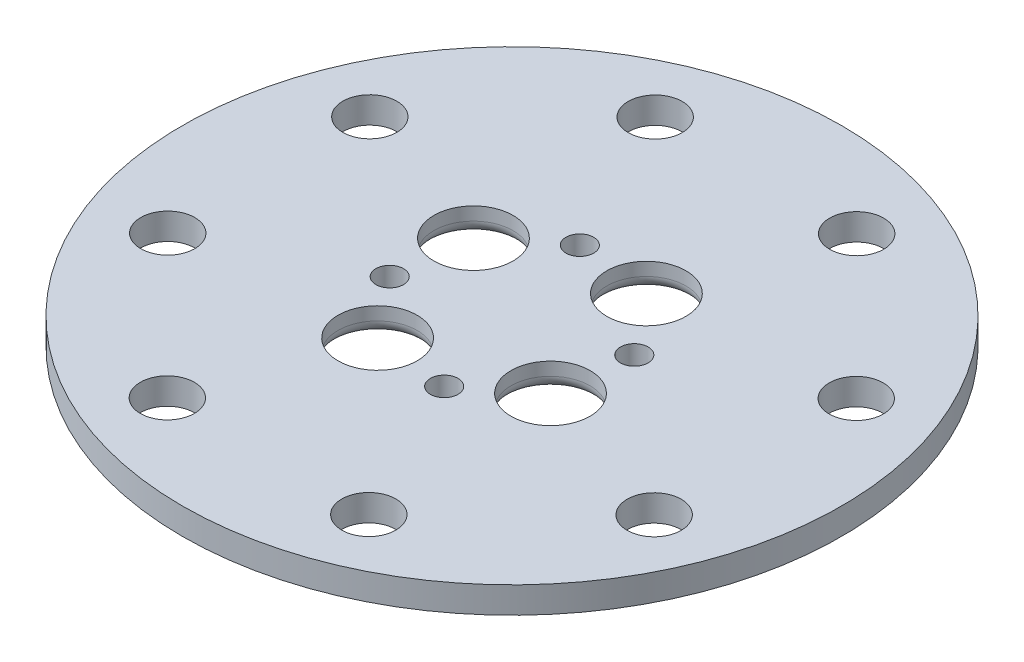
ISO-10303-21;
HEADER;
FILE_DESCRIPTION(('STEP AP214'),'2;1');
FILE_NAME('part.step','',(''),(''),'','','');
FILE_SCHEMA(('AUTOMOTIVE_DESIGN { 1 0 10303 214 1 1 1 1 }'));
ENDSEC;
DATA;
#1=APPLICATION_CONTEXT('core data for automotive mechanical design processes');
#2=APPLICATION_PROTOCOL_DEFINITION('international standard','automotive_design',2000,#1);
#3=PRODUCT_CONTEXT('',#1,'mechanical');
#4=PRODUCT('Part','Part','',(#3));
#5=PRODUCT_RELATED_PRODUCT_CATEGORY('part','',(#4));
#6=PRODUCT_DEFINITION_FORMATION('','',#4);
#7=PRODUCT_DEFINITION_CONTEXT('part definition',#1,'design');
#8=PRODUCT_DEFINITION('design','',#6,#7);
#9=PRODUCT_DEFINITION_SHAPE('','',#8);
#10=(LENGTH_UNIT() NAMED_UNIT(*) SI_UNIT(.MILLI.,.METRE.));
#11=(NAMED_UNIT(*) PLANE_ANGLE_UNIT() SI_UNIT($,.RADIAN.));
#12=(NAMED_UNIT(*) SI_UNIT($,.STERADIAN.) SOLID_ANGLE_UNIT());
#13=UNCERTAINTY_MEASURE_WITH_UNIT(LENGTH_MEASURE(1.E-05),#10,'distance_accuracy_value','');
#14=(GEOMETRIC_REPRESENTATION_CONTEXT(3) GLOBAL_UNCERTAINTY_ASSIGNED_CONTEXT((#13)) GLOBAL_UNIT_ASSIGNED_CONTEXT((#10,
#11,#12)) REPRESENTATION_CONTEXT('',''));
#15=CARTESIAN_POINT('',(0.,0.,0.));
#16=DIRECTION('',(0.,0.,1.));
#17=DIRECTION('',(1.,0.,0.));
#18=AXIS2_PLACEMENT_3D('',#15,#16,#17);
#19=CARTESIAN_POINT('',(0.,2.,0.));
#20=DIRECTION('',(0.,-1.,0.));
#21=DIRECTION('',(0.,0.,-1.));
#22=AXIS2_PLACEMENT_3D('',#19,#20,#21);
#23=CYLINDRICAL_SURFACE('',#22,25.);
#24=CARTESIAN_POINT('',(0.,2.,0.));
#25=DIRECTION('',(0.,1.,0.));
#26=DIRECTION('',(0.,0.,1.));
#27=AXIS2_PLACEMENT_3D('',#24,#25,#26);
#28=CIRCLE('',#27,25.);
#29=CARTESIAN_POINT('',(0.,2.,25.));
#30=VERTEX_POINT('',#29);
#31=EDGE_CURVE('E82',#30,#30,#28,.T.);
#32=ORIENTED_EDGE('',*,*,#31,.F.);
#33=EDGE_LOOP('',(#32));
#34=FACE_BOUND('',#33,.T.);
#35=CARTESIAN_POINT('',(0.,0.,0.));
#36=DIRECTION('',(0.,1.,0.));
#37=DIRECTION('',(0.,0.,1.));
#38=AXIS2_PLACEMENT_3D('',#35,#36,#37);
#39=CIRCLE('',#38,25.);
#40=CARTESIAN_POINT('',(0.,0.,25.));
#41=VERTEX_POINT('',#40);
#42=EDGE_CURVE('E83',#41,#41,#39,.T.);
#43=ORIENTED_EDGE('',*,*,#42,.T.);
#44=EDGE_LOOP('',(#43));
#45=FACE_BOUND('',#44,.T.);
#46=ADVANCED_FACE('F40',(#34,#45),#23,.T.);
#47=CARTESIAN_POINT('',(0.,2.,0.));
#48=DIRECTION('',(0.,1.,0.));
#49=DIRECTION('',(0.,0.,1.));
#50=AXIS2_PLACEMENT_3D('',#47,#48,#49);
#51=PLANE('',#50);
#52=CARTESIAN_POINT('',(-7.68064256948644,2.,18.4663946053315));
#53=DIRECTION('',(0.,-1.,0.));
#54=DIRECTION('',(0.,0.,-1.));
#55=AXIS2_PLACEMENT_3D('',#52,#53,#54);
#56=CIRCLE('',#55,2.05);
#57=CARTESIAN_POINT('',(-7.68064256948644,2.,16.4163946053315));
#58=VERTEX_POINT('',#57);
#59=EDGE_CURVE('E143',#58,#58,#56,.T.);
#60=ORIENTED_EDGE('',*,*,#59,.T.);
#61=EDGE_LOOP('',(#60));
#62=FACE_BOUND('',#61,.T.);
#63=CARTESIAN_POINT('',(7.62667840474221,2.,18.488747294251));
#64=DIRECTION('',(0.,-1.,0.));
#65=DIRECTION('',(0.,0.,-1.));
#66=AXIS2_PLACEMENT_3D('',#63,#64,#65);
#67=CIRCLE('',#66,2.05);
#68=CARTESIAN_POINT('',(7.62667840474221,2.,16.438747294251));
#69=VERTEX_POINT('',#68);
#70=EDGE_CURVE('E168',#69,#69,#67,.T.);
#71=ORIENTED_EDGE('',*,*,#70,.T.);
#72=EDGE_LOOP('',(#71));
#73=FACE_BOUND('',#72,.T.);
#74=CARTESIAN_POINT('',(18.4663946053311,2.,7.68064256948754));
#75=DIRECTION('',(0.,-1.,0.));
#76=DIRECTION('',(0.,0.,-1.));
#77=AXIS2_PLACEMENT_3D('',#74,#75,#76);
#78=CIRCLE('',#77,2.05);
#79=CARTESIAN_POINT('',(18.4663946053311,2.,5.63064256948754));
#80=VERTEX_POINT('',#79);
#81=EDGE_CURVE('E160',#80,#80,#78,.T.);
#82=ORIENTED_EDGE('',*,*,#81,.T.);
#83=EDGE_LOOP('',(#82));
#84=FACE_BOUND('',#83,.T.);
#85=CARTESIAN_POINT('',(18.4887472942505,2.,-7.62667840474111));
#86=DIRECTION('',(0.,-1.,0.));
#87=DIRECTION('',(0.,0.,-1.));
#88=AXIS2_PLACEMENT_3D('',#85,#86,#87);
#89=CIRCLE('',#88,2.05);
#90=CARTESIAN_POINT('',(18.4887472942505,2.,-9.67667840474111));
#91=VERTEX_POINT('',#90);
#92=EDGE_CURVE('E151',#91,#91,#89,.T.);
#93=ORIENTED_EDGE('',*,*,#92,.T.);
#94=EDGE_LOOP('',(#93));
#95=FACE_BOUND('',#94,.T.);
#96=CARTESIAN_POINT('',(7.6806425694871,2.,-18.46639460533));
#97=DIRECTION('',(0.,-1.,0.));
#98=DIRECTION('',(0.,0.,-1.));
#99=AXIS2_PLACEMENT_3D('',#96,#97,#98);
#100=CIRCLE('',#99,2.05);
#101=CARTESIAN_POINT('',(7.6806425694871,2.,-20.51639460533));
#102=VERTEX_POINT('',#101);
#103=EDGE_CURVE('E152',#102,#102,#100,.T.);
#104=ORIENTED_EDGE('',*,*,#103,.T.);
#105=EDGE_LOOP('',(#104));
#106=FACE_BOUND('',#105,.T.);
#107=CARTESIAN_POINT('',(-7.62667840474155,2.,-18.4887472942494));
#108=DIRECTION('',(0.,-1.,0.));
#109=DIRECTION('',(0.,0.,-1.));
#110=AXIS2_PLACEMENT_3D('',#107,#108,#109);
#111=CIRCLE('',#110,2.05);
#112=CARTESIAN_POINT('',(-7.62667840474155,2.,-20.5387472942494));
#113=VERTEX_POINT('',#112);
#114=EDGE_CURVE('E191',#113,#113,#111,.T.);
#115=ORIENTED_EDGE('',*,*,#114,.T.);
#116=EDGE_LOOP('',(#115));
#117=FACE_BOUND('',#116,.T.);
#118=CARTESIAN_POINT('',(-18.4663946053304,2.,-7.68064256948599));
#119=DIRECTION('',(0.,-1.,0.));
#120=DIRECTION('',(0.,0.,-1.));
#121=AXIS2_PLACEMENT_3D('',#118,#119,#120);
#122=CIRCLE('',#121,2.05);
#123=CARTESIAN_POINT('',(-18.4663946053304,2.,-9.73064256948599));
#124=VERTEX_POINT('',#123);
#125=EDGE_CURVE('E183',#124,#124,#122,.T.);
#126=ORIENTED_EDGE('',*,*,#125,.T.);
#127=EDGE_LOOP('',(#126));
#128=FACE_BOUND('',#127,.T.);
#129=CARTESIAN_POINT('',(-18.4887472942499,2.,7.62667840474266));
#130=DIRECTION('',(0.,-1.,0.));
#131=DIRECTION('',(0.,0.,-1.));
#132=AXIS2_PLACEMENT_3D('',#129,#130,#131);
#133=CIRCLE('',#132,2.05);
#134=CARTESIAN_POINT('',(-18.4887472942499,2.,5.57667840474266));
#135=VERTEX_POINT('',#134);
#136=EDGE_CURVE('E132',#135,#135,#133,.T.);
#137=ORIENTED_EDGE('',*,*,#136,.T.);
#138=EDGE_LOOP('',(#137));
#139=FACE_BOUND('',#138,.T.);
#140=CARTESIAN_POINT('',(-7.20972393812874,2.,2.06636897382066));
#141=DIRECTION('',(0.,1.,0.));
#142=DIRECTION('',(0.,0.,1.));
#143=AXIS2_PLACEMENT_3D('',#140,#141,#142);
#144=CIRCLE('',#143,1.05);
#145=CARTESIAN_POINT('',(-7.20972393812874,2.,3.11636897382066));
#146=VERTEX_POINT('',#145);
#147=EDGE_CURVE('E111',#146,#146,#144,.T.);
#148=ORIENTED_EDGE('',*,*,#147,.F.);
#149=EDGE_LOOP('',(#148));
#150=FACE_BOUND('',#149,.T.);
#151=CARTESIAN_POINT('',(2.06636897382105,2.,7.20972393812896));
#152=DIRECTION('',(0.,1.,0.));
#153=DIRECTION('',(0.,0.,1.));
#154=AXIS2_PLACEMENT_3D('',#151,#152,#153);
#155=CIRCLE('',#154,1.05);
#156=CARTESIAN_POINT('',(2.06636897382105,2.,8.25972393812896));
#157=VERTEX_POINT('',#156);
#158=EDGE_CURVE('E120',#157,#157,#155,.T.);
#159=ORIENTED_EDGE('',*,*,#158,.F.);
#160=EDGE_LOOP('',(#159));
#161=FACE_BOUND('',#160,.T.);
#162=CARTESIAN_POINT('',(7.20972393812935,2.,-2.06636897382083));
#163=DIRECTION('',(0.,1.,0.));
#164=DIRECTION('',(0.,0.,1.));
#165=AXIS2_PLACEMENT_3D('',#162,#163,#164);
#166=CIRCLE('',#165,1.05);
#167=CARTESIAN_POINT('',(7.20972393812935,2.,-1.01636897382083));
#168=VERTEX_POINT('',#167);
#169=EDGE_CURVE('E99',#168,#168,#166,.T.);
#170=ORIENTED_EDGE('',*,*,#169,.F.);
#171=EDGE_LOOP('',(#170));
#172=FACE_BOUND('',#171,.T.);
#173=CARTESIAN_POINT('',(-3.63690117331162,2.,6.55918820095631));
#174=DIRECTION('',(0.,1.,0.));
#175=DIRECTION('',(0.,0.,1.));
#176=AXIS2_PLACEMENT_3D('',#173,#174,#175);
#177=CIRCLE('',#176,3.);
#178=CARTESIAN_POINT('',(-3.63690117331162,2.,9.55918820095631));
#179=VERTEX_POINT('',#178);
#180=EDGE_CURVE('E95',#179,#179,#177,.T.);
#181=ORIENTED_EDGE('',*,*,#180,.F.);
#182=EDGE_LOOP('',(#181));
#183=FACE_BOUND('',#182,.T.);
#184=CARTESIAN_POINT('',(-6.5591882009563,2.,-3.63690117331165));
#185=DIRECTION('',(0.,1.,0.));
#186=DIRECTION('',(0.,0.,1.));
#187=AXIS2_PLACEMENT_3D('',#184,#185,#186);
#188=CIRCLE('',#187,3.);
#189=CARTESIAN_POINT('',(-6.5591882009563,2.,-0.636901173311649));
#190=VERTEX_POINT('',#189);
#191=EDGE_CURVE('E116',#190,#190,#188,.T.);
#192=ORIENTED_EDGE('',*,*,#191,.F.);
#193=EDGE_LOOP('',(#192));
#194=FACE_BOUND('',#193,.T.);
#195=CARTESIAN_POINT('',(3.63690117331167,2.,-6.55918820095629));
#196=DIRECTION('',(0.,1.,0.));
#197=DIRECTION('',(0.,0.,1.));
#198=AXIS2_PLACEMENT_3D('',#195,#196,#197);
#199=CIRCLE('',#198,3.);
#200=CARTESIAN_POINT('',(3.63690117331167,2.,-3.55918820095629));
#201=VERTEX_POINT('',#200);
#202=EDGE_CURVE('E131',#201,#201,#199,.T.);
#203=ORIENTED_EDGE('',*,*,#202,.F.);
#204=EDGE_LOOP('',(#203));
#205=FACE_BOUND('',#204,.T.);
#206=CARTESIAN_POINT('',(6.55918820095628,2.,3.63690117331169));
#207=DIRECTION('',(0.,1.,0.));
#208=DIRECTION('',(0.,0.,1.));
#209=AXIS2_PLACEMENT_3D('',#206,#207,#208);
#210=CIRCLE('',#209,3.);
#211=CARTESIAN_POINT('',(6.55918820095628,2.,6.63690117331169));
#212=VERTEX_POINT('',#211);
#213=EDGE_CURVE('E127',#212,#212,#210,.T.);
#214=ORIENTED_EDGE('',*,*,#213,.F.);
#215=EDGE_LOOP('',(#214));
#216=FACE_BOUND('',#215,.T.);
#217=CARTESIAN_POINT('',(-2.06636897382044,2.,-7.20972393812913));
#218=DIRECTION('',(0.,1.,0.));
#219=DIRECTION('',(0.,0.,1.));
#220=AXIS2_PLACEMENT_3D('',#217,#218,#219);
#221=CIRCLE('',#220,1.05);
#222=CARTESIAN_POINT('',(-2.06636897382044,2.,-6.15972393812913));
#223=VERTEX_POINT('',#222);
#224=EDGE_CURVE('E91',#223,#223,#221,.T.);
#225=ORIENTED_EDGE('',*,*,#224,.F.);
#226=EDGE_LOOP('',(#225));
#227=FACE_BOUND('',#226,.T.);
#228=ORIENTED_EDGE('',*,*,#31,.T.);
#229=EDGE_LOOP('',(#228));
#230=FACE_BOUND('',#229,.T.);
#231=ADVANCED_FACE('F204',(#62,#73,#84,#95,#106,#117,#128,#139,#150,#161,#172,#183,#194,#205,
#216,#227,#230),#51,.T.);
#232=CARTESIAN_POINT('',(0.,0.,0.));
#233=DIRECTION('',(0.,1.,0.));
#234=DIRECTION('',(0.,0.,1.));
#235=AXIS2_PLACEMENT_3D('',#232,#233,#234);
#236=PLANE('',#235);
#237=CARTESIAN_POINT('',(-7.68064256948644,0.,18.4663946053315));
#238=DIRECTION('',(0.,-1.,0.));
#239=DIRECTION('',(0.,0.,-1.));
#240=AXIS2_PLACEMENT_3D('',#237,#238,#239);
#241=CIRCLE('',#240,2.05);
#242=CARTESIAN_POINT('',(-7.68064256948644,0.,16.4163946053315));
#243=VERTEX_POINT('',#242);
#244=EDGE_CURVE('E172',#243,#243,#241,.T.);
#245=ORIENTED_EDGE('',*,*,#244,.F.);
#246=EDGE_LOOP('',(#245));
#247=FACE_BOUND('',#246,.T.);
#248=CARTESIAN_POINT('',(7.62667840474221,0.,18.488747294251));
#249=DIRECTION('',(0.,-1.,0.));
#250=DIRECTION('',(0.,0.,-1.));
#251=AXIS2_PLACEMENT_3D('',#248,#249,#250);
#252=CIRCLE('',#251,2.05);
#253=CARTESIAN_POINT('',(7.62667840474221,0.,16.438747294251));
#254=VERTEX_POINT('',#253);
#255=EDGE_CURVE('E164',#254,#254,#252,.T.);
#256=ORIENTED_EDGE('',*,*,#255,.F.);
#257=EDGE_LOOP('',(#256));
#258=FACE_BOUND('',#257,.T.);
#259=CARTESIAN_POINT('',(18.4663946053311,0.,7.68064256948754));
#260=DIRECTION('',(0.,-1.,0.));
#261=DIRECTION('',(0.,0.,-1.));
#262=AXIS2_PLACEMENT_3D('',#259,#260,#261);
#263=CIRCLE('',#262,2.05);
#264=CARTESIAN_POINT('',(18.4663946053311,0.,5.63064256948754));
#265=VERTEX_POINT('',#264);
#266=EDGE_CURVE('E156',#265,#265,#263,.T.);
#267=ORIENTED_EDGE('',*,*,#266,.F.);
#268=EDGE_LOOP('',(#267));
#269=FACE_BOUND('',#268,.T.);
#270=CARTESIAN_POINT('',(18.4887472942505,0.,-7.62667840474111));
#271=DIRECTION('',(0.,-1.,0.));
#272=DIRECTION('',(0.,0.,-1.));
#273=AXIS2_PLACEMENT_3D('',#270,#271,#272);
#274=CIRCLE('',#273,2.05);
#275=CARTESIAN_POINT('',(18.4887472942505,0.,-9.67667840474111));
#276=VERTEX_POINT('',#275);
#277=EDGE_CURVE('E147',#276,#276,#274,.T.);
#278=ORIENTED_EDGE('',*,*,#277,.F.);
#279=EDGE_LOOP('',(#278));
#280=FACE_BOUND('',#279,.T.);
#281=CARTESIAN_POINT('',(7.6806425694871,0.,-18.46639460533));
#282=DIRECTION('',(0.,-1.,0.));
#283=DIRECTION('',(0.,0.,-1.));
#284=AXIS2_PLACEMENT_3D('',#281,#282,#283);
#285=CIRCLE('',#284,2.05);
#286=CARTESIAN_POINT('',(7.6806425694871,0.,-20.51639460533));
#287=VERTEX_POINT('',#286);
#288=EDGE_CURVE('E195',#287,#287,#285,.T.);
#289=ORIENTED_EDGE('',*,*,#288,.F.);
#290=EDGE_LOOP('',(#289));
#291=FACE_BOUND('',#290,.T.);
#292=CARTESIAN_POINT('',(-7.62667840474155,0.,-18.4887472942494));
#293=DIRECTION('',(0.,-1.,0.));
#294=DIRECTION('',(0.,0.,-1.));
#295=AXIS2_PLACEMENT_3D('',#292,#293,#294);
#296=CIRCLE('',#295,2.05);
#297=CARTESIAN_POINT('',(-7.62667840474155,0.,-20.5387472942494));
#298=VERTEX_POINT('',#297);
#299=EDGE_CURVE('E187',#298,#298,#296,.T.);
#300=ORIENTED_EDGE('',*,*,#299,.F.);
#301=EDGE_LOOP('',(#300));
#302=FACE_BOUND('',#301,.T.);
#303=CARTESIAN_POINT('',(-18.4663946053304,0.,-7.68064256948599));
#304=DIRECTION('',(0.,-1.,0.));
#305=DIRECTION('',(0.,0.,-1.));
#306=AXIS2_PLACEMENT_3D('',#303,#304,#305);
#307=CIRCLE('',#306,2.05);
#308=CARTESIAN_POINT('',(-18.4663946053304,0.,-9.73064256948599));
#309=VERTEX_POINT('',#308);
#310=EDGE_CURVE('E179',#309,#309,#307,.T.);
#311=ORIENTED_EDGE('',*,*,#310,.F.);
#312=EDGE_LOOP('',(#311));
#313=FACE_BOUND('',#312,.T.);
#314=CARTESIAN_POINT('',(-18.4887472942499,0.,7.62667840474266));
#315=DIRECTION('',(0.,-1.,0.));
#316=DIRECTION('',(0.,0.,-1.));
#317=AXIS2_PLACEMENT_3D('',#314,#315,#316);
#318=CIRCLE('',#317,2.05);
#319=CARTESIAN_POINT('',(-18.4887472942499,0.,5.57667840474266));
#320=VERTEX_POINT('',#319);
#321=EDGE_CURVE('E139',#320,#320,#318,.T.);
#322=ORIENTED_EDGE('',*,*,#321,.F.);
#323=EDGE_LOOP('',(#322));
#324=FACE_BOUND('',#323,.T.);
#325=CARTESIAN_POINT('',(-6.5591882009563,0.,-3.63690117331165));
#326=DIRECTION('',(0.,1.,0.));
#327=DIRECTION('',(0.,0.,1.));
#328=AXIS2_PLACEMENT_3D('',#325,#326,#327);
#329=CIRCLE('',#328,4.);
#330=CARTESIAN_POINT('',(-6.5591882009563,0.,0.363098826688352));
#331=VERTEX_POINT('',#330);
#332=EDGE_CURVE('E66',#331,#331,#329,.T.);
#333=ORIENTED_EDGE('',*,*,#332,.T.);
#334=EDGE_LOOP('',(#333));
#335=FACE_BOUND('',#334,.T.);
#336=CARTESIAN_POINT('',(3.63690117331167,0.,-6.55918820095629));
#337=DIRECTION('',(0.,1.,0.));
#338=DIRECTION('',(0.,0.,1.));
#339=AXIS2_PLACEMENT_3D('',#336,#337,#338);
#340=CIRCLE('',#339,4.);
#341=CARTESIAN_POINT('',(3.63690117331167,0.,-2.55918820095629));
#342=VERTEX_POINT('',#341);
#343=EDGE_CURVE('E70',#342,#342,#340,.T.);
#344=ORIENTED_EDGE('',*,*,#343,.T.);
#345=EDGE_LOOP('',(#344));
#346=FACE_BOUND('',#345,.T.);
#347=CARTESIAN_POINT('',(6.55918820095628,0.,3.63690117331169));
#348=DIRECTION('',(0.,1.,0.));
#349=DIRECTION('',(0.,0.,1.));
#350=AXIS2_PLACEMENT_3D('',#347,#348,#349);
#351=CIRCLE('',#350,4.);
#352=CARTESIAN_POINT('',(6.55918820095628,0.,7.63690117331169));
#353=VERTEX_POINT('',#352);
#354=EDGE_CURVE('E74',#353,#353,#351,.T.);
#355=ORIENTED_EDGE('',*,*,#354,.T.);
#356=EDGE_LOOP('',(#355));
#357=FACE_BOUND('',#356,.T.);
#358=CARTESIAN_POINT('',(-3.63690117331162,0.,6.55918820095631));
#359=DIRECTION('',(0.,1.,0.));
#360=DIRECTION('',(0.,0.,1.));
#361=AXIS2_PLACEMENT_3D('',#358,#359,#360);
#362=CIRCLE('',#361,4.);
#363=CARTESIAN_POINT('',(-3.63690117331162,0.,10.5591882009563));
#364=VERTEX_POINT('',#363);
#365=EDGE_CURVE('E78',#364,#364,#362,.T.);
#366=ORIENTED_EDGE('',*,*,#365,.T.);
#367=EDGE_LOOP('',(#366));
#368=FACE_BOUND('',#367,.T.);
#369=CARTESIAN_POINT('',(-7.20972393812874,0.,2.06636897382066));
#370=DIRECTION('',(0.,1.,0.));
#371=DIRECTION('',(0.,0.,1.));
#372=AXIS2_PLACEMENT_3D('',#369,#370,#371);
#373=CIRCLE('',#372,1.05);
#374=CARTESIAN_POINT('',(-7.20972393812874,0.,3.11636897382066));
#375=VERTEX_POINT('',#374);
#376=EDGE_CURVE('E115',#375,#375,#373,.T.);
#377=ORIENTED_EDGE('',*,*,#376,.T.);
#378=EDGE_LOOP('',(#377));
#379=FACE_BOUND('',#378,.T.);
#380=CARTESIAN_POINT('',(2.06636897382105,0.,7.20972393812896));
#381=DIRECTION('',(0.,1.,0.));
#382=DIRECTION('',(0.,0.,1.));
#383=AXIS2_PLACEMENT_3D('',#380,#381,#382);
#384=CIRCLE('',#383,1.05);
#385=CARTESIAN_POINT('',(2.06636897382105,0.,8.25972393812896));
#386=VERTEX_POINT('',#385);
#387=EDGE_CURVE('E104',#386,#386,#384,.T.);
#388=ORIENTED_EDGE('',*,*,#387,.T.);
#389=EDGE_LOOP('',(#388));
#390=FACE_BOUND('',#389,.T.);
#391=CARTESIAN_POINT('',(7.20972393812935,0.,-2.06636897382083));
#392=DIRECTION('',(0.,1.,0.));
#393=DIRECTION('',(0.,0.,1.));
#394=AXIS2_PLACEMENT_3D('',#391,#392,#393);
#395=CIRCLE('',#394,1.05);
#396=CARTESIAN_POINT('',(7.20972393812935,0.,-1.01636897382083));
#397=VERTEX_POINT('',#396);
#398=EDGE_CURVE('E103',#397,#397,#395,.T.);
#399=ORIENTED_EDGE('',*,*,#398,.T.);
#400=EDGE_LOOP('',(#399));
#401=FACE_BOUND('',#400,.T.);
#402=CARTESIAN_POINT('',(-2.06636897382044,0.,-7.20972393812913));
#403=DIRECTION('',(0.,1.,0.));
#404=DIRECTION('',(0.,0.,1.));
#405=AXIS2_PLACEMENT_3D('',#402,#403,#404);
#406=CIRCLE('',#405,1.05);
#407=CARTESIAN_POINT('',(-2.06636897382044,0.,-6.15972393812913));
#408=VERTEX_POINT('',#407);
#409=EDGE_CURVE('E87',#408,#408,#406,.T.);
#410=ORIENTED_EDGE('',*,*,#409,.T.);
#411=EDGE_LOOP('',(#410));
#412=FACE_BOUND('',#411,.T.);
#413=ORIENTED_EDGE('',*,*,#42,.F.);
#414=EDGE_LOOP('',(#413));
#415=FACE_BOUND('',#414,.T.);
#416=ADVANCED_FACE('F215',(#247,#258,#269,#280,#291,#302,#313,#324,#335,#346,#357,#368,#379,
#390,#401,#412,#415),#236,.F.);
#417=CARTESIAN_POINT('',(-2.06636897382044,0.,-7.20972393812913));
#418=DIRECTION('',(0.,1.,0.));
#419=DIRECTION('',(0.,0.,1.));
#420=AXIS2_PLACEMENT_3D('',#417,#418,#419);
#421=CYLINDRICAL_SURFACE('',#420,1.05);
#422=ORIENTED_EDGE('',*,*,#409,.F.);
#423=EDGE_LOOP('',(#422));
#424=FACE_BOUND('',#423,.T.);
#425=ORIENTED_EDGE('',*,*,#224,.T.);
#426=EDGE_LOOP('',(#425));
#427=FACE_BOUND('',#426,.T.);
#428=ADVANCED_FACE('F218',(#424,#427),#421,.F.);
#429=CARTESIAN_POINT('',(6.55918820095628,0.,3.63690117331169));
#430=DIRECTION('',(0.,1.,0.));
#431=DIRECTION('',(0.,0.,1.));
#432=AXIS2_PLACEMENT_3D('',#429,#430,#431);
#433=CYLINDRICAL_SURFACE('',#432,3.);
#434=CARTESIAN_POINT('',(6.55918820095628,1.,3.63690117331169));
#435=DIRECTION('',(0.,1.,0.));
#436=DIRECTION('',(0.,0.,1.));
#437=AXIS2_PLACEMENT_3D('',#434,#435,#436);
#438=CIRCLE('',#437,3.);
#439=CARTESIAN_POINT('',(6.55918820095628,1.,6.63690117331169));
#440=VERTEX_POINT('',#439);
#441=EDGE_CURVE('E48',#440,#440,#438,.F.);
#442=ORIENTED_EDGE('',*,*,#441,.T.);
#443=EDGE_LOOP('',(#442));
#444=FACE_BOUND('',#443,.T.);
#445=ORIENTED_EDGE('',*,*,#213,.T.);
#446=EDGE_LOOP('',(#445));
#447=FACE_BOUND('',#446,.T.);
#448=ADVANCED_FACE('F297',(#444,#447),#433,.F.);
#449=CARTESIAN_POINT('',(3.63690117331167,0.,-6.55918820095629));
#450=DIRECTION('',(0.,1.,0.));
#451=DIRECTION('',(0.,0.,1.));
#452=AXIS2_PLACEMENT_3D('',#449,#450,#451);
#453=CYLINDRICAL_SURFACE('',#452,3.);
#454=CARTESIAN_POINT('',(3.63690117331167,1.,-6.55918820095629));
#455=DIRECTION('',(0.,1.,0.));
#456=DIRECTION('',(0.,0.,1.));
#457=AXIS2_PLACEMENT_3D('',#454,#455,#456);
#458=CIRCLE('',#457,3.);
#459=CARTESIAN_POINT('',(3.63690117331167,1.,-3.55918820095629));
#460=VERTEX_POINT('',#459);
#461=EDGE_CURVE('E54',#460,#460,#458,.F.);
#462=ORIENTED_EDGE('',*,*,#461,.T.);
#463=EDGE_LOOP('',(#462));
#464=FACE_BOUND('',#463,.T.);
#465=ORIENTED_EDGE('',*,*,#202,.T.);
#466=EDGE_LOOP('',(#465));
#467=FACE_BOUND('',#466,.T.);
#468=ADVANCED_FACE('F293',(#464,#467),#453,.F.);
#469=CARTESIAN_POINT('',(-6.5591882009563,0.,-3.63690117331165));
#470=DIRECTION('',(0.,1.,0.));
#471=DIRECTION('',(0.,0.,1.));
#472=AXIS2_PLACEMENT_3D('',#469,#470,#471);
#473=CYLINDRICAL_SURFACE('',#472,3.);
#474=CARTESIAN_POINT('',(-6.5591882009563,1.,-3.63690117331165));
#475=DIRECTION('',(0.,1.,0.));
#476=DIRECTION('',(0.,0.,1.));
#477=AXIS2_PLACEMENT_3D('',#474,#475,#476);
#478=CIRCLE('',#477,3.);
#479=CARTESIAN_POINT('',(-6.5591882009563,1.,-0.636901173311649));
#480=VERTEX_POINT('',#479);
#481=EDGE_CURVE('E60',#480,#480,#478,.F.);
#482=ORIENTED_EDGE('',*,*,#481,.T.);
#483=EDGE_LOOP('',(#482));
#484=FACE_BOUND('',#483,.T.);
#485=ORIENTED_EDGE('',*,*,#191,.T.);
#486=EDGE_LOOP('',(#485));
#487=FACE_BOUND('',#486,.T.);
#488=ADVANCED_FACE('F289',(#484,#487),#473,.F.);
#489=CARTESIAN_POINT('',(-3.63690117331162,0.,6.55918820095631));
#490=DIRECTION('',(0.,1.,0.));
#491=DIRECTION('',(0.,0.,1.));
#492=AXIS2_PLACEMENT_3D('',#489,#490,#491);
#493=CYLINDRICAL_SURFACE('',#492,3.);
#494=CARTESIAN_POINT('',(-3.63690117331162,1.,6.55918820095631));
#495=DIRECTION('',(0.,1.,0.));
#496=DIRECTION('',(0.,0.,1.));
#497=AXIS2_PLACEMENT_3D('',#494,#495,#496);
#498=CIRCLE('',#497,3.);
#499=CARTESIAN_POINT('',(-3.63690117331162,1.,9.55918820095631));
#500=VERTEX_POINT('',#499);
#501=EDGE_CURVE('E10',#500,#500,#498,.F.);
#502=ORIENTED_EDGE('',*,*,#501,.T.);
#503=EDGE_LOOP('',(#502));
#504=FACE_BOUND('',#503,.T.);
#505=ORIENTED_EDGE('',*,*,#180,.T.);
#506=EDGE_LOOP('',(#505));
#507=FACE_BOUND('',#506,.T.);
#508=ADVANCED_FACE('F292',(#504,#507),#493,.F.);
#509=CARTESIAN_POINT('',(7.20972393812935,0.,-2.06636897382083));
#510=DIRECTION('',(0.,1.,0.));
#511=DIRECTION('',(0.,0.,1.));
#512=AXIS2_PLACEMENT_3D('',#509,#510,#511);
#513=CYLINDRICAL_SURFACE('',#512,1.05);
#514=ORIENTED_EDGE('',*,*,#398,.F.);
#515=EDGE_LOOP('',(#514));
#516=FACE_BOUND('',#515,.T.);
#517=ORIENTED_EDGE('',*,*,#169,.T.);
#518=EDGE_LOOP('',(#517));
#519=FACE_BOUND('',#518,.T.);
#520=ADVANCED_FACE('F304',(#516,#519),#513,.F.);
#521=CARTESIAN_POINT('',(2.06636897382105,0.,7.20972393812896));
#522=DIRECTION('',(0.,1.,0.));
#523=DIRECTION('',(0.,0.,1.));
#524=AXIS2_PLACEMENT_3D('',#521,#522,#523);
#525=CYLINDRICAL_SURFACE('',#524,1.05);
#526=ORIENTED_EDGE('',*,*,#387,.F.);
#527=EDGE_LOOP('',(#526));
#528=FACE_BOUND('',#527,.T.);
#529=ORIENTED_EDGE('',*,*,#158,.T.);
#530=EDGE_LOOP('',(#529));
#531=FACE_BOUND('',#530,.T.);
#532=ADVANCED_FACE('F301',(#528,#531),#525,.F.);
#533=CARTESIAN_POINT('',(-7.20972393812874,0.,2.06636897382066));
#534=DIRECTION('',(0.,1.,0.));
#535=DIRECTION('',(0.,0.,1.));
#536=AXIS2_PLACEMENT_3D('',#533,#534,#535);
#537=CYLINDRICAL_SURFACE('',#536,1.05);
#538=ORIENTED_EDGE('',*,*,#376,.F.);
#539=EDGE_LOOP('',(#538));
#540=FACE_BOUND('',#539,.T.);
#541=ORIENTED_EDGE('',*,*,#147,.T.);
#542=EDGE_LOOP('',(#541));
#543=FACE_BOUND('',#542,.T.);
#544=ADVANCED_FACE('F259',(#540,#543),#537,.F.);
#545=CARTESIAN_POINT('',(-6.5591882009563,1.,-3.63690117331165));
#546=DIRECTION('',(0.,1.,0.));
#547=DIRECTION('',(0.,0.,1.));
#548=AXIS2_PLACEMENT_3D('',#545,#546,#547);
#549=TOROIDAL_SURFACE('',#548,4.,1.);
#550=ORIENTED_EDGE('',*,*,#481,.F.);
#551=EDGE_LOOP('',(#550));
#552=FACE_BOUND('',#551,.T.);
#553=ORIENTED_EDGE('',*,*,#332,.F.);
#554=EDGE_LOOP('',(#553));
#555=FACE_BOUND('',#554,.T.);
#556=ADVANCED_FACE('F255',(#552,#555),#549,.T.);
#557=CARTESIAN_POINT('',(3.63690117331167,1.,-6.55918820095629));
#558=DIRECTION('',(0.,1.,0.));
#559=DIRECTION('',(0.,0.,1.));
#560=AXIS2_PLACEMENT_3D('',#557,#558,#559);
#561=TOROIDAL_SURFACE('',#560,4.,1.);
#562=ORIENTED_EDGE('',*,*,#461,.F.);
#563=EDGE_LOOP('',(#562));
#564=FACE_BOUND('',#563,.T.);
#565=ORIENTED_EDGE('',*,*,#343,.F.);
#566=EDGE_LOOP('',(#565));
#567=FACE_BOUND('',#566,.T.);
#568=ADVANCED_FACE('F258',(#564,#567),#561,.T.);
#569=CARTESIAN_POINT('',(6.55918820095628,1.,3.63690117331169));
#570=DIRECTION('',(0.,1.,0.));
#571=DIRECTION('',(0.,0.,1.));
#572=AXIS2_PLACEMENT_3D('',#569,#570,#571);
#573=TOROIDAL_SURFACE('',#572,4.,1.);
#574=ORIENTED_EDGE('',*,*,#441,.F.);
#575=EDGE_LOOP('',(#574));
#576=FACE_BOUND('',#575,.T.);
#577=ORIENTED_EDGE('',*,*,#354,.F.);
#578=EDGE_LOOP('',(#577));
#579=FACE_BOUND('',#578,.T.);
#580=ADVANCED_FACE('F262',(#576,#579),#573,.T.);
#581=CARTESIAN_POINT('',(-3.63690117331162,1.,6.55918820095631));
#582=DIRECTION('',(0.,1.,0.));
#583=DIRECTION('',(0.,0.,1.));
#584=AXIS2_PLACEMENT_3D('',#581,#582,#583);
#585=TOROIDAL_SURFACE('',#584,4.,1.);
#586=ORIENTED_EDGE('',*,*,#501,.F.);
#587=EDGE_LOOP('',(#586));
#588=FACE_BOUND('',#587,.T.);
#589=ORIENTED_EDGE('',*,*,#365,.F.);
#590=EDGE_LOOP('',(#589));
#591=FACE_BOUND('',#590,.T.);
#592=ADVANCED_FACE('F42',(#588,#591),#585,.T.);
#593=CARTESIAN_POINT('',(-18.4887472942499,2.,7.62667840474266));
#594=DIRECTION('',(0.,-1.,0.));
#595=DIRECTION('',(0.,0.,-1.));
#596=AXIS2_PLACEMENT_3D('',#593,#594,#595);
#597=CYLINDRICAL_SURFACE('',#596,2.05);
#598=ORIENTED_EDGE('',*,*,#136,.F.);
#599=EDGE_LOOP('',(#598));
#600=FACE_BOUND('',#599,.T.);
#601=ORIENTED_EDGE('',*,*,#321,.T.);
#602=EDGE_LOOP('',(#601));
#603=FACE_BOUND('',#602,.T.);
#604=ADVANCED_FACE('F269',(#600,#603),#597,.F.);
#605=CARTESIAN_POINT('',(-18.4663946053304,2.,-7.68064256948599));
#606=DIRECTION('',(0.,-1.,0.));
#607=DIRECTION('',(0.,0.,-1.));
#608=AXIS2_PLACEMENT_3D('',#605,#606,#607);
#609=CYLINDRICAL_SURFACE('',#608,2.05);
#610=ORIENTED_EDGE('',*,*,#125,.F.);
#611=EDGE_LOOP('',(#610));
#612=FACE_BOUND('',#611,.T.);
#613=ORIENTED_EDGE('',*,*,#310,.T.);
#614=EDGE_LOOP('',(#613));
#615=FACE_BOUND('',#614,.T.);
#616=ADVANCED_FACE('F275',(#612,#615),#609,.F.);
#617=CARTESIAN_POINT('',(-7.62667840474155,2.,-18.4887472942494));
#618=DIRECTION('',(0.,-1.,0.));
#619=DIRECTION('',(0.,0.,-1.));
#620=AXIS2_PLACEMENT_3D('',#617,#618,#619);
#621=CYLINDRICAL_SURFACE('',#620,2.05);
#622=ORIENTED_EDGE('',*,*,#114,.F.);
#623=EDGE_LOOP('',(#622));
#624=FACE_BOUND('',#623,.T.);
#625=ORIENTED_EDGE('',*,*,#299,.T.);
#626=EDGE_LOOP('',(#625));
#627=FACE_BOUND('',#626,.T.);
#628=ADVANCED_FACE('F211',(#624,#627),#621,.F.);
#629=CARTESIAN_POINT('',(7.6806425694871,2.,-18.46639460533));
#630=DIRECTION('',(0.,-1.,0.));
#631=DIRECTION('',(0.,0.,-1.));
#632=AXIS2_PLACEMENT_3D('',#629,#630,#631);
#633=CYLINDRICAL_SURFACE('',#632,2.05);
#634=ORIENTED_EDGE('',*,*,#103,.F.);
#635=EDGE_LOOP('',(#634));
#636=FACE_BOUND('',#635,.T.);
#637=ORIENTED_EDGE('',*,*,#288,.T.);
#638=EDGE_LOOP('',(#637));
#639=FACE_BOUND('',#638,.T.);
#640=ADVANCED_FACE('F207',(#636,#639),#633,.F.);
#641=CARTESIAN_POINT('',(18.4887472942505,2.,-7.62667840474111));
#642=DIRECTION('',(0.,-1.,0.));
#643=DIRECTION('',(0.,0.,-1.));
#644=AXIS2_PLACEMENT_3D('',#641,#642,#643);
#645=CYLINDRICAL_SURFACE('',#644,2.05);
#646=ORIENTED_EDGE('',*,*,#92,.F.);
#647=EDGE_LOOP('',(#646));
#648=FACE_BOUND('',#647,.T.);
#649=ORIENTED_EDGE('',*,*,#277,.T.);
#650=EDGE_LOOP('',(#649));
#651=FACE_BOUND('',#650,.T.);
#652=ADVANCED_FACE('F210',(#648,#651),#645,.F.);
#653=CARTESIAN_POINT('',(18.4663946053311,2.,7.68064256948754));
#654=DIRECTION('',(0.,-1.,0.));
#655=DIRECTION('',(0.,0.,-1.));
#656=AXIS2_PLACEMENT_3D('',#653,#654,#655);
#657=CYLINDRICAL_SURFACE('',#656,2.05);
#658=ORIENTED_EDGE('',*,*,#81,.F.);
#659=EDGE_LOOP('',(#658));
#660=FACE_BOUND('',#659,.T.);
#661=ORIENTED_EDGE('',*,*,#266,.T.);
#662=EDGE_LOOP('',(#661));
#663=FACE_BOUND('',#662,.T.);
#664=ADVANCED_FACE('F404',(#660,#663),#657,.F.);
#665=CARTESIAN_POINT('',(7.62667840474221,2.,18.488747294251));
#666=DIRECTION('',(0.,-1.,0.));
#667=DIRECTION('',(0.,0.,-1.));
#668=AXIS2_PLACEMENT_3D('',#665,#666,#667);
#669=CYLINDRICAL_SURFACE('',#668,2.05);
#670=ORIENTED_EDGE('',*,*,#70,.F.);
#671=EDGE_LOOP('',(#670));
#672=FACE_BOUND('',#671,.T.);
#673=ORIENTED_EDGE('',*,*,#255,.T.);
#674=EDGE_LOOP('',(#673));
#675=FACE_BOUND('',#674,.T.);
#676=ADVANCED_FACE('F413',(#672,#675),#669,.F.);
#677=CARTESIAN_POINT('',(-7.68064256948644,2.,18.4663946053315));
#678=DIRECTION('',(0.,-1.,0.));
#679=DIRECTION('',(0.,0.,-1.));
#680=AXIS2_PLACEMENT_3D('',#677,#678,#679);
#681=CYLINDRICAL_SURFACE('',#680,2.05);
#682=ORIENTED_EDGE('',*,*,#59,.F.);
#683=EDGE_LOOP('',(#682));
#684=FACE_BOUND('',#683,.T.);
#685=ORIENTED_EDGE('',*,*,#244,.T.);
#686=EDGE_LOOP('',(#685));
#687=FACE_BOUND('',#686,.T.);
#688=ADVANCED_FACE('F422',(#684,#687),#681,.F.);
#689=CLOSED_SHELL('',(#46,#231,#416,#428,#448,#468,#488,#508,#520,#532,#544,#556,#568,#580,#592,
#604,#616,#628,#640,#652,#664,#676,#688));
#690=MANIFOLD_SOLID_BREP('B2',#689);
#691=ADVANCED_BREP_SHAPE_REPRESENTATION('',(#18,#690),#14);
#692=SHAPE_DEFINITION_REPRESENTATION(#9,#691);
ENDSEC;
END-ISO-10303-21;
